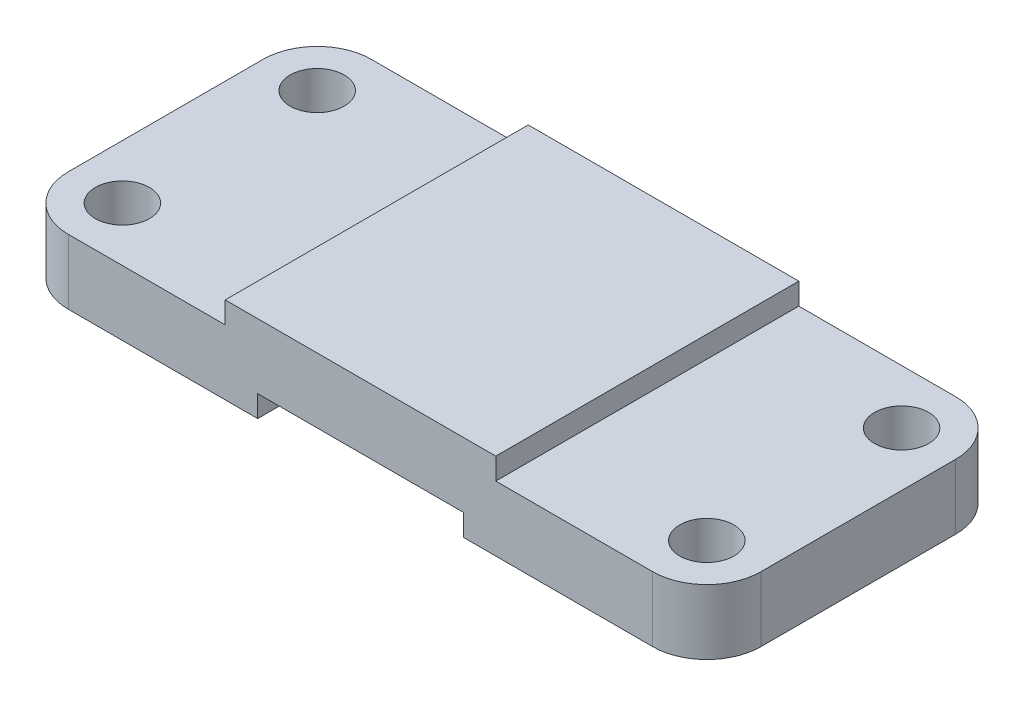
ISO-10303-21;
HEADER;
FILE_DESCRIPTION(('STEP AP214'),'2;1');
FILE_NAME('part.step','',(''),(''),'','','');
FILE_SCHEMA(('AUTOMOTIVE_DESIGN { 1 0 10303 214 1 1 1 1 }'));
ENDSEC;
DATA;
#1=APPLICATION_CONTEXT('core data for automotive mechanical design processes');
#2=APPLICATION_PROTOCOL_DEFINITION('international standard','automotive_design',2000,#1);
#3=PRODUCT_CONTEXT('',#1,'mechanical');
#4=PRODUCT('Part','Part','',(#3));
#5=PRODUCT_RELATED_PRODUCT_CATEGORY('part','',(#4));
#6=PRODUCT_DEFINITION_FORMATION('','',#4);
#7=PRODUCT_DEFINITION_CONTEXT('part definition',#1,'design');
#8=PRODUCT_DEFINITION('design','',#6,#7);
#9=PRODUCT_DEFINITION_SHAPE('','',#8);
#10=(LENGTH_UNIT() NAMED_UNIT(*) SI_UNIT(.MILLI.,.METRE.));
#11=(NAMED_UNIT(*) PLANE_ANGLE_UNIT() SI_UNIT($,.RADIAN.));
#12=(NAMED_UNIT(*) SI_UNIT($,.STERADIAN.) SOLID_ANGLE_UNIT());
#13=UNCERTAINTY_MEASURE_WITH_UNIT(LENGTH_MEASURE(1.E-05),#10,'distance_accuracy_value','');
#14=(GEOMETRIC_REPRESENTATION_CONTEXT(3) GLOBAL_UNCERTAINTY_ASSIGNED_CONTEXT((#13)) GLOBAL_UNIT_ASSIGNED_CONTEXT((#10,
#11,#12)) REPRESENTATION_CONTEXT('',''));
#15=CARTESIAN_POINT('',(0.,0.,0.));
#16=DIRECTION('',(0.,0.,1.));
#17=DIRECTION('',(1.,0.,0.));
#18=AXIS2_PLACEMENT_3D('',#15,#16,#17);
#19=CARTESIAN_POINT('',(0.,0.,0.));
#20=DIRECTION('',(0.,1.,0.));
#21=DIRECTION('',(0.,0.,1.));
#22=AXIS2_PLACEMENT_3D('',#19,#20,#21);
#23=PLANE('',#22);
#24=CARTESIAN_POINT('',(-79.,0.,-10.));
#25=DIRECTION('',(0.,1.,0.));
#26=DIRECTION('',(0.,0.,1.));
#27=AXIS2_PLACEMENT_3D('',#24,#25,#26);
#28=CIRCLE('',#27,5.);
#29=CARTESIAN_POINT('',(-79.,0.,-5.));
#30=VERTEX_POINT('',#29);
#31=EDGE_CURVE('E210',#30,#30,#28,.T.);
#32=ORIENTED_EDGE('',*,*,#31,.T.);
#33=EDGE_LOOP('',(#32));
#34=FACE_BOUND('',#33,.T.);
#35=CARTESIAN_POINT('',(-79.,0.,-46.));
#36=DIRECTION('',(0.,1.,0.));
#37=DIRECTION('',(0.,0.,1.));
#38=AXIS2_PLACEMENT_3D('',#35,#36,#37);
#39=CIRCLE('',#38,5.00000000000001);
#40=CARTESIAN_POINT('',(-79.,0.,-41.));
#41=VERTEX_POINT('',#40);
#42=EDGE_CURVE('E222',#41,#41,#39,.T.);
#43=ORIENTED_EDGE('',*,*,#42,.T.);
#44=EDGE_LOOP('',(#43));
#45=FACE_BOUND('',#44,.T.);
#46=DIRECTION('',(-1.,0.,0.));
#47=VECTOR('',#46,1.);
#48=CARTESIAN_POINT('',(0.,0.,-56.));
#49=LINE('',#48,#47);
#50=CARTESIAN_POINT('',(-44.,0.,-56.));
#51=VERTEX_POINT('',#50);
#52=CARTESIAN_POINT('',(-79.,0.,-56.));
#53=VERTEX_POINT('',#52);
#54=EDGE_CURVE('E293',#51,#53,#49,.T.);
#55=ORIENTED_EDGE('',*,*,#54,.F.);
#56=DIRECTION('',(0.,0.,1.));
#57=VECTOR('',#56,1.);
#58=CARTESIAN_POINT('',(-44.,0.,-56.));
#59=LINE('',#58,#57);
#60=CARTESIAN_POINT('',(-44.,0.,0.));
#61=VERTEX_POINT('',#60);
#62=EDGE_CURVE('E197',#51,#61,#59,.T.);
#63=ORIENTED_EDGE('',*,*,#62,.T.);
#64=DIRECTION('',(-1.,0.,0.));
#65=VECTOR('',#64,1.);
#66=CARTESIAN_POINT('',(0.,0.,0.));
#67=LINE('',#66,#65);
#68=CARTESIAN_POINT('',(-79.,0.,0.));
#69=VERTEX_POINT('',#68);
#70=EDGE_CURVE('E271',#61,#69,#67,.T.);
#71=ORIENTED_EDGE('',*,*,#70,.T.);
#72=CARTESIAN_POINT('',(-79.,0.,-10.));
#73=DIRECTION('',(0.,1.,0.));
#74=DIRECTION('',(0.,0.,1.));
#75=AXIS2_PLACEMENT_3D('',#72,#73,#74);
#76=CIRCLE('',#75,10.);
#77=CARTESIAN_POINT('',(-89.,0.,-10.));
#78=VERTEX_POINT('',#77);
#79=EDGE_CURVE('E317',#69,#78,#76,.F.);
#80=ORIENTED_EDGE('',*,*,#79,.T.);
#81=DIRECTION('',(0.,0.,1.));
#82=VECTOR('',#81,1.);
#83=CARTESIAN_POINT('',(-89.,0.,0.));
#84=LINE('',#83,#82);
#85=CARTESIAN_POINT('',(-89.,0.,-46.));
#86=VERTEX_POINT('',#85);
#87=EDGE_CURVE('E253',#86,#78,#84,.T.);
#88=ORIENTED_EDGE('',*,*,#87,.F.);
#89=CARTESIAN_POINT('',(-79.,0.,-46.));
#90=DIRECTION('',(0.,1.,0.));
#91=DIRECTION('',(0.,0.,1.));
#92=AXIS2_PLACEMENT_3D('',#89,#90,#91);
#93=CIRCLE('',#92,10.);
#94=EDGE_CURVE('E320',#86,#53,#93,.F.);
#95=ORIENTED_EDGE('',*,*,#94,.T.);
#96=EDGE_LOOP('',(#55,#63,#71,#80,#88,#95));
#97=FACE_BOUND('',#96,.T.);
#98=ADVANCED_FACE('F45',(#34,#45,#97),#23,.F.);
#99=CARTESIAN_POINT('',(-50.,16.,0.));
#100=DIRECTION('',(-1.,0.,0.));
#101=DIRECTION('',(0.,0.,1.));
#102=AXIS2_PLACEMENT_3D('',#99,#100,#101);
#103=PLANE('',#102);
#104=DIRECTION('',(0.,0.,-1.));
#105=VECTOR('',#104,1.);
#106=CARTESIAN_POINT('',(-50.,12.,0.));
#107=LINE('',#106,#105);
#108=CARTESIAN_POINT('',(-50.,12.,0.));
#109=VERTEX_POINT('',#108);
#110=CARTESIAN_POINT('',(-50.,12.,-56.));
#111=VERTEX_POINT('',#110);
#112=EDGE_CURVE('E263',#109,#111,#107,.T.);
#113=ORIENTED_EDGE('',*,*,#112,.F.);
#114=DIRECTION('',(0.,-1.,0.));
#115=VECTOR('',#114,1.);
#116=CARTESIAN_POINT('',(-50.,16.,0.));
#117=LINE('',#116,#115);
#118=CARTESIAN_POINT('',(-50.,16.,0.));
#119=VERTEX_POINT('',#118);
#120=EDGE_CURVE('E306',#119,#109,#117,.T.);
#121=ORIENTED_EDGE('',*,*,#120,.F.);
#122=DIRECTION('',(0.,0.,-1.));
#123=VECTOR('',#122,1.);
#124=CARTESIAN_POINT('',(-50.,16.,0.));
#125=LINE('',#124,#123);
#126=CARTESIAN_POINT('',(-50.,16.,-56.));
#127=VERTEX_POINT('',#126);
#128=EDGE_CURVE('E274',#119,#127,#125,.T.);
#129=ORIENTED_EDGE('',*,*,#128,.T.);
#130=DIRECTION('',(0.,-1.,0.));
#131=VECTOR('',#130,1.);
#132=CARTESIAN_POINT('',(-50.,16.,-56.));
#133=LINE('',#132,#131);
#134=EDGE_CURVE('E288',#127,#111,#133,.T.);
#135=ORIENTED_EDGE('',*,*,#134,.T.);
#136=EDGE_LOOP('',(#113,#121,#129,#135));
#137=FACE_BOUND('',#136,.T.);
#138=ADVANCED_FACE('F413',(#137),#103,.T.);
#139=CARTESIAN_POINT('',(0.,16.,0.));
#140=DIRECTION('',(0.,0.,1.));
#141=DIRECTION('',(1.,0.,0.));
#142=AXIS2_PLACEMENT_3D('',#139,#140,#141);
#143=PLANE('',#142);
#144=DIRECTION('',(0.,-1.,0.));
#145=VECTOR('',#144,1.);
#146=CARTESIAN_POINT('',(-44.,0.,0.));
#147=LINE('',#146,#145);
#148=CARTESIAN_POINT('',(-44.,4.,0.));
#149=VERTEX_POINT('',#148);
#150=EDGE_CURVE('E185',#149,#61,#147,.T.);
#151=ORIENTED_EDGE('',*,*,#150,.F.);
#152=DIRECTION('',(-1.,0.,0.));
#153=VECTOR('',#152,1.);
#154=CARTESIAN_POINT('',(-44.,4.,0.));
#155=LINE('',#154,#153);
#156=CARTESIAN_POINT('',(-6.00000000000001,4.,0.));
#157=VERTEX_POINT('',#156);
#158=EDGE_CURVE('E188',#157,#149,#155,.T.);
#159=ORIENTED_EDGE('',*,*,#158,.F.);
#160=DIRECTION('',(0.,1.,0.));
#161=VECTOR('',#160,1.);
#162=CARTESIAN_POINT('',(-6.00000000000001,4.,0.));
#163=LINE('',#162,#161);
#164=CARTESIAN_POINT('',(-6.00000000000001,0.,0.));
#165=VERTEX_POINT('',#164);
#166=EDGE_CURVE('E162',#165,#157,#163,.T.);
#167=ORIENTED_EDGE('',*,*,#166,.F.);
#168=CARTESIAN_POINT('',(29.,0.,0.));
#169=VERTEX_POINT('',#168);
#170=EDGE_CURVE('E289',#169,#165,#67,.T.);
#171=ORIENTED_EDGE('',*,*,#170,.F.);
#172=DIRECTION('',(0.,-1.,0.));
#173=VECTOR('',#172,1.);
#174=CARTESIAN_POINT('',(29.,12.,0.));
#175=LINE('',#174,#173);
#176=CARTESIAN_POINT('',(29.,12.,0.));
#177=VERTEX_POINT('',#176);
#178=EDGE_CURVE('E334',#169,#177,#175,.F.);
#179=ORIENTED_EDGE('',*,*,#178,.T.);
#180=DIRECTION('',(1.,0.,0.));
#181=VECTOR('',#180,1.);
#182=CARTESIAN_POINT('',(0.,12.,0.));
#183=LINE('',#182,#181);
#184=CARTESIAN_POINT('',(0.,12.,0.));
#185=VERTEX_POINT('',#184);
#186=EDGE_CURVE('E249',#185,#177,#183,.T.);
#187=ORIENTED_EDGE('',*,*,#186,.F.);
#188=DIRECTION('',(0.,-1.,0.));
#189=VECTOR('',#188,1.);
#190=CARTESIAN_POINT('',(0.,16.,0.));
#191=LINE('',#190,#189);
#192=CARTESIAN_POINT('',(0.,16.,0.));
#193=VERTEX_POINT('',#192);
#194=EDGE_CURVE('E302',#193,#185,#191,.T.);
#195=ORIENTED_EDGE('',*,*,#194,.F.);
#196=DIRECTION('',(-1.,0.,0.));
#197=VECTOR('',#196,1.);
#198=CARTESIAN_POINT('',(0.,16.,0.));
#199=LINE('',#198,#197);
#200=EDGE_CURVE('E278',#193,#119,#199,.T.);
#201=ORIENTED_EDGE('',*,*,#200,.T.);
#202=ORIENTED_EDGE('',*,*,#120,.T.);
#203=DIRECTION('',(1.,0.,0.));
#204=VECTOR('',#203,1.);
#205=CARTESIAN_POINT('',(0.,12.,0.));
#206=LINE('',#205,#204);
#207=CARTESIAN_POINT('',(-79.,12.,0.));
#208=VERTEX_POINT('',#207);
#209=EDGE_CURVE('E260',#208,#109,#206,.T.);
#210=ORIENTED_EDGE('',*,*,#209,.F.);
#211=DIRECTION('',(0.,-1.,0.));
#212=VECTOR('',#211,1.);
#213=CARTESIAN_POINT('',(-79.,0.,0.));
#214=LINE('',#213,#212);
#215=EDGE_CURVE('E330',#208,#69,#214,.T.);
#216=ORIENTED_EDGE('',*,*,#215,.T.);
#217=ORIENTED_EDGE('',*,*,#70,.F.);
#218=EDGE_LOOP('',(#151,#159,#167,#171,#179,#187,#195,#201,#202,#210,#216,#217));
#219=FACE_BOUND('',#218,.T.);
#220=ADVANCED_FACE('F364',(#219),#143,.T.);
#221=CARTESIAN_POINT('',(0.,16.,0.));
#222=DIRECTION('',(-1.,0.,0.));
#223=DIRECTION('',(0.,0.,1.));
#224=AXIS2_PLACEMENT_3D('',#221,#222,#223);
#225=PLANE('',#224);
#226=ORIENTED_EDGE('',*,*,#194,.T.);
#227=DIRECTION('',(0.,0.,-1.));
#228=VECTOR('',#227,1.);
#229=CARTESIAN_POINT('',(0.,12.,0.));
#230=LINE('',#229,#228);
#231=CARTESIAN_POINT('',(0.,12.,-56.));
#232=VERTEX_POINT('',#231);
#233=EDGE_CURVE('E245',#185,#232,#230,.T.);
#234=ORIENTED_EDGE('',*,*,#233,.T.);
#235=DIRECTION('',(0.,-1.,0.));
#236=VECTOR('',#235,1.);
#237=CARTESIAN_POINT('',(0.,16.,-56.));
#238=LINE('',#237,#236);
#239=CARTESIAN_POINT('',(0.,16.,-56.));
#240=VERTEX_POINT('',#239);
#241=EDGE_CURVE('E298',#240,#232,#238,.T.);
#242=ORIENTED_EDGE('',*,*,#241,.F.);
#243=DIRECTION('',(0.,0.,-1.));
#244=VECTOR('',#243,1.);
#245=CARTESIAN_POINT('',(0.,16.,0.));
#246=LINE('',#245,#244);
#247=EDGE_CURVE('E282',#193,#240,#246,.T.);
#248=ORIENTED_EDGE('',*,*,#247,.F.);
#249=EDGE_LOOP('',(#226,#234,#242,#248));
#250=FACE_BOUND('',#249,.T.);
#251=ADVANCED_FACE('F405',(#250),#225,.F.);
#252=CARTESIAN_POINT('',(0.,16.,-56.));
#253=DIRECTION('',(0.,0.,1.));
#254=DIRECTION('',(1.,0.,0.));
#255=AXIS2_PLACEMENT_3D('',#252,#253,#254);
#256=PLANE('',#255);
#257=DIRECTION('',(-1.,0.,0.));
#258=VECTOR('',#257,1.);
#259=CARTESIAN_POINT('',(-44.,4.,-56.));
#260=LINE('',#259,#258);
#261=CARTESIAN_POINT('',(-6.00000000000001,4.,-56.));
#262=VERTEX_POINT('',#261);
#263=CARTESIAN_POINT('',(-44.,4.,-56.));
#264=VERTEX_POINT('',#263);
#265=EDGE_CURVE('E171',#262,#264,#260,.T.);
#266=ORIENTED_EDGE('',*,*,#265,.T.);
#267=DIRECTION('',(0.,-1.,0.));
#268=VECTOR('',#267,1.);
#269=CARTESIAN_POINT('',(-44.,0.,-56.));
#270=LINE('',#269,#268);
#271=EDGE_CURVE('E177',#264,#51,#270,.T.);
#272=ORIENTED_EDGE('',*,*,#271,.T.);
#273=ORIENTED_EDGE('',*,*,#54,.T.);
#274=DIRECTION('',(0.,-1.,0.));
#275=VECTOR('',#274,1.);
#276=CARTESIAN_POINT('',(-79.,16.,-56.));
#277=LINE('',#276,#275);
#278=CARTESIAN_POINT('',(-79.,12.,-56.));
#279=VERTEX_POINT('',#278);
#280=EDGE_CURVE('E343',#53,#279,#277,.F.);
#281=ORIENTED_EDGE('',*,*,#280,.T.);
#282=DIRECTION('',(-1.,0.,0.));
#283=VECTOR('',#282,1.);
#284=CARTESIAN_POINT('',(0.,12.,-56.));
#285=LINE('',#284,#283);
#286=EDGE_CURVE('E267',#111,#279,#285,.T.);
#287=ORIENTED_EDGE('',*,*,#286,.F.);
#288=ORIENTED_EDGE('',*,*,#134,.F.);
#289=DIRECTION('',(-1.,0.,0.));
#290=VECTOR('',#289,1.);
#291=CARTESIAN_POINT('',(0.,16.,-56.));
#292=LINE('',#291,#290);
#293=EDGE_CURVE('E285',#240,#127,#292,.T.);
#294=ORIENTED_EDGE('',*,*,#293,.F.);
#295=ORIENTED_EDGE('',*,*,#241,.T.);
#296=DIRECTION('',(-1.,0.,0.));
#297=VECTOR('',#296,1.);
#298=CARTESIAN_POINT('',(0.,12.,-56.));
#299=LINE('',#298,#297);
#300=CARTESIAN_POINT('',(29.,12.,-56.));
#301=VERTEX_POINT('',#300);
#302=EDGE_CURVE('E242',#301,#232,#299,.T.);
#303=ORIENTED_EDGE('',*,*,#302,.F.);
#304=DIRECTION('',(0.,-1.,0.));
#305=VECTOR('',#304,1.);
#306=CARTESIAN_POINT('',(29.,16.,-56.));
#307=LINE('',#306,#305);
#308=CARTESIAN_POINT('',(29.,0.,-56.));
#309=VERTEX_POINT('',#308);
#310=EDGE_CURVE('E346',#301,#309,#307,.T.);
#311=ORIENTED_EDGE('',*,*,#310,.T.);
#312=CARTESIAN_POINT('',(-6.00000000000001,0.,-56.));
#313=VERTEX_POINT('',#312);
#314=EDGE_CURVE('E183',#309,#313,#49,.T.);
#315=ORIENTED_EDGE('',*,*,#314,.T.);
#316=DIRECTION('',(0.,1.,0.));
#317=VECTOR('',#316,1.);
#318=CARTESIAN_POINT('',(-6.00000000000001,4.,-56.));
#319=LINE('',#318,#317);
#320=EDGE_CURVE('E61',#313,#262,#319,.T.);
#321=ORIENTED_EDGE('',*,*,#320,.T.);
#322=EDGE_LOOP('',(#266,#272,#273,#281,#287,#288,#294,#295,#303,#311,#315,#321));
#323=FACE_BOUND('',#322,.T.);
#324=ADVANCED_FACE('F180',(#323),#256,.F.);
#325=CARTESIAN_POINT('',(0.,16.,0.));
#326=DIRECTION('',(0.,1.,0.));
#327=DIRECTION('',(0.,0.,1.));
#328=AXIS2_PLACEMENT_3D('',#325,#326,#327);
#329=PLANE('',#328);
#330=ORIENTED_EDGE('',*,*,#128,.F.);
#331=ORIENTED_EDGE('',*,*,#200,.F.);
#332=ORIENTED_EDGE('',*,*,#247,.T.);
#333=ORIENTED_EDGE('',*,*,#293,.T.);
#334=EDGE_LOOP('',(#330,#331,#332,#333));
#335=FACE_BOUND('',#334,.T.);
#336=ADVANCED_FACE('F410',(#335),#329,.T.);
#337=CARTESIAN_POINT('',(29.,0.,-46.));
#338=DIRECTION('',(0.,1.,0.));
#339=DIRECTION('',(0.,0.,1.));
#340=AXIS2_PLACEMENT_3D('',#337,#338,#339);
#341=CIRCLE('',#340,5.);
#342=CARTESIAN_POINT('',(29.,0.,-41.));
#343=VERTEX_POINT('',#342);
#344=EDGE_CURVE('E206',#343,#343,#341,.T.);
#345=ORIENTED_EDGE('',*,*,#344,.T.);
#346=EDGE_LOOP('',(#345));
#347=FACE_BOUND('',#346,.T.);
#348=CARTESIAN_POINT('',(29.,0.,-10.));
#349=DIRECTION('',(0.,1.,0.));
#350=DIRECTION('',(0.,0.,1.));
#351=AXIS2_PLACEMENT_3D('',#348,#349,#350);
#352=CIRCLE('',#351,5.);
#353=CARTESIAN_POINT('',(29.,0.,-5.));
#354=VERTEX_POINT('',#353);
#355=EDGE_CURVE('E201',#354,#354,#352,.T.);
#356=ORIENTED_EDGE('',*,*,#355,.T.);
#357=EDGE_LOOP('',(#356));
#358=FACE_BOUND('',#357,.T.);
#359=ORIENTED_EDGE('',*,*,#170,.T.);
#360=DIRECTION('',(0.,0.,1.));
#361=VECTOR('',#360,1.);
#362=CARTESIAN_POINT('',(-6.00000000000001,0.,-56.));
#363=LINE('',#362,#361);
#364=EDGE_CURVE('E168',#313,#165,#363,.T.);
#365=ORIENTED_EDGE('',*,*,#364,.F.);
#366=ORIENTED_EDGE('',*,*,#314,.F.);
#367=CARTESIAN_POINT('',(29.,0.,-46.));
#368=DIRECTION('',(0.,1.,0.));
#369=DIRECTION('',(0.,0.,1.));
#370=AXIS2_PLACEMENT_3D('',#367,#368,#369);
#371=CIRCLE('',#370,10.);
#372=CARTESIAN_POINT('',(39.,0.,-46.));
#373=VERTEX_POINT('',#372);
#374=EDGE_CURVE('E324',#309,#373,#371,.F.);
#375=ORIENTED_EDGE('',*,*,#374,.T.);
#376=DIRECTION('',(0.,0.,-1.));
#377=VECTOR('',#376,1.);
#378=CARTESIAN_POINT('',(39.,0.,0.));
#379=LINE('',#378,#377);
#380=CARTESIAN_POINT('',(39.,0.,-10.));
#381=VERTEX_POINT('',#380);
#382=EDGE_CURVE('E226',#381,#373,#379,.T.);
#383=ORIENTED_EDGE('',*,*,#382,.F.);
#384=CARTESIAN_POINT('',(29.,0.,-10.));
#385=DIRECTION('',(0.,1.,0.));
#386=DIRECTION('',(0.,0.,1.));
#387=AXIS2_PLACEMENT_3D('',#384,#385,#386);
#388=CIRCLE('',#387,10.);
#389=EDGE_CURVE('E327',#381,#169,#388,.F.);
#390=ORIENTED_EDGE('',*,*,#389,.T.);
#391=EDGE_LOOP('',(#359,#365,#366,#375,#383,#390));
#392=FACE_BOUND('',#391,.T.);
#393=ADVANCED_FACE('F384',(#347,#358,#392),#23,.F.);
#394=CARTESIAN_POINT('',(-89.,12.,0.));
#395=DIRECTION('',(1.,0.,0.));
#396=DIRECTION('',(0.,0.,-1.));
#397=AXIS2_PLACEMENT_3D('',#394,#395,#396);
#398=PLANE('',#397);
#399=DIRECTION('',(0.,0.,1.));
#400=VECTOR('',#399,1.);
#401=CARTESIAN_POINT('',(-89.,12.,0.));
#402=LINE('',#401,#400);
#403=CARTESIAN_POINT('',(-89.,12.,-46.));
#404=VERTEX_POINT('',#403);
#405=CARTESIAN_POINT('',(-89.,12.,-10.));
#406=VERTEX_POINT('',#405);
#407=EDGE_CURVE('E257',#404,#406,#402,.T.);
#408=ORIENTED_EDGE('',*,*,#407,.F.);
#409=DIRECTION('',(0.,-1.,0.));
#410=VECTOR('',#409,1.);
#411=CARTESIAN_POINT('',(-89.,12.,-46.));
#412=LINE('',#411,#410);
#413=EDGE_CURVE('E351',#404,#86,#412,.T.);
#414=ORIENTED_EDGE('',*,*,#413,.T.);
#415=ORIENTED_EDGE('',*,*,#87,.T.);
#416=DIRECTION('',(0.,-1.,0.));
#417=VECTOR('',#416,1.);
#418=CARTESIAN_POINT('',(-89.,12.,-10.));
#419=LINE('',#418,#417);
#420=EDGE_CURVE('E69',#78,#406,#419,.F.);
#421=ORIENTED_EDGE('',*,*,#420,.T.);
#422=EDGE_LOOP('',(#408,#414,#415,#421));
#423=FACE_BOUND('',#422,.T.);
#424=ADVANCED_FACE('F370',(#423),#398,.F.);
#425=CARTESIAN_POINT('',(0.,12.,0.));
#426=DIRECTION('',(0.,1.,0.));
#427=DIRECTION('',(0.,0.,1.));
#428=AXIS2_PLACEMENT_3D('',#425,#426,#427);
#429=PLANE('',#428);
#430=CARTESIAN_POINT('',(-79.,12.,-46.));
#431=DIRECTION('',(0.,1.,0.));
#432=DIRECTION('',(0.,0.,1.));
#433=AXIS2_PLACEMENT_3D('',#430,#431,#432);
#434=CIRCLE('',#433,5.00000000000001);
#435=CARTESIAN_POINT('',(-79.,12.,-41.));
#436=VERTEX_POINT('',#435);
#437=EDGE_CURVE('E227',#436,#436,#434,.T.);
#438=ORIENTED_EDGE('',*,*,#437,.F.);
#439=EDGE_LOOP('',(#438));
#440=FACE_BOUND('',#439,.T.);
#441=CARTESIAN_POINT('',(-79.,12.,-10.));
#442=DIRECTION('',(0.,1.,0.));
#443=DIRECTION('',(0.,0.,1.));
#444=AXIS2_PLACEMENT_3D('',#441,#442,#443);
#445=CIRCLE('',#444,5.);
#446=CARTESIAN_POINT('',(-79.,12.,-5.));
#447=VERTEX_POINT('',#446);
#448=EDGE_CURVE('E231',#447,#447,#445,.T.);
#449=ORIENTED_EDGE('',*,*,#448,.F.);
#450=EDGE_LOOP('',(#449));
#451=FACE_BOUND('',#450,.T.);
#452=ORIENTED_EDGE('',*,*,#286,.T.);
#453=CARTESIAN_POINT('',(-79.,12.,-46.));
#454=DIRECTION('',(0.,1.,0.));
#455=DIRECTION('',(0.,0.,1.));
#456=AXIS2_PLACEMENT_3D('',#453,#454,#455);
#457=CIRCLE('',#456,10.);
#458=EDGE_CURVE('E11',#279,#404,#457,.T.);
#459=ORIENTED_EDGE('',*,*,#458,.T.);
#460=ORIENTED_EDGE('',*,*,#407,.T.);
#461=CARTESIAN_POINT('',(-79.,12.,-10.));
#462=DIRECTION('',(0.,1.,0.));
#463=DIRECTION('',(0.,0.,1.));
#464=AXIS2_PLACEMENT_3D('',#461,#462,#463);
#465=CIRCLE('',#464,10.);
#466=EDGE_CURVE('E54',#406,#208,#465,.T.);
#467=ORIENTED_EDGE('',*,*,#466,.T.);
#468=ORIENTED_EDGE('',*,*,#209,.T.);
#469=ORIENTED_EDGE('',*,*,#112,.T.);
#470=EDGE_LOOP('',(#452,#459,#460,#467,#468,#469));
#471=FACE_BOUND('',#470,.T.);
#472=ADVANCED_FACE('F358',(#440,#451,#471),#429,.T.);
#473=CARTESIAN_POINT('',(39.,12.,0.));
#474=DIRECTION('',(-1.,0.,0.));
#475=DIRECTION('',(0.,0.,1.));
#476=AXIS2_PLACEMENT_3D('',#473,#474,#475);
#477=PLANE('',#476);
#478=DIRECTION('',(0.,0.,-1.));
#479=VECTOR('',#478,1.);
#480=CARTESIAN_POINT('',(39.,12.,0.));
#481=LINE('',#480,#479);
#482=CARTESIAN_POINT('',(39.,12.,-10.));
#483=VERTEX_POINT('',#482);
#484=CARTESIAN_POINT('',(39.,12.,-46.));
#485=VERTEX_POINT('',#484);
#486=EDGE_CURVE('E238',#483,#485,#481,.T.);
#487=ORIENTED_EDGE('',*,*,#486,.F.);
#488=DIRECTION('',(0.,-1.,0.));
#489=VECTOR('',#488,1.);
#490=CARTESIAN_POINT('',(39.,0.,-10.));
#491=LINE('',#490,#489);
#492=EDGE_CURVE('E313',#483,#381,#491,.T.);
#493=ORIENTED_EDGE('',*,*,#492,.T.);
#494=ORIENTED_EDGE('',*,*,#382,.T.);
#495=DIRECTION('',(0.,-1.,0.));
#496=VECTOR('',#495,1.);
#497=CARTESIAN_POINT('',(39.,12.,-46.));
#498=LINE('',#497,#496);
#499=EDGE_CURVE('E310',#373,#485,#498,.F.);
#500=ORIENTED_EDGE('',*,*,#499,.T.);
#501=EDGE_LOOP('',(#487,#493,#494,#500));
#502=FACE_BOUND('',#501,.T.);
#503=ADVANCED_FACE('F392',(#502),#477,.F.);
#504=CARTESIAN_POINT('',(0.,12.,0.));
#505=DIRECTION('',(0.,1.,0.));
#506=DIRECTION('',(0.,0.,1.));
#507=AXIS2_PLACEMENT_3D('',#504,#505,#506);
#508=PLANE('',#507);
#509=CARTESIAN_POINT('',(29.,12.,-46.));
#510=DIRECTION('',(0.,1.,0.));
#511=DIRECTION('',(0.,0.,1.));
#512=AXIS2_PLACEMENT_3D('',#509,#510,#511);
#513=CIRCLE('',#512,5.);
#514=CARTESIAN_POINT('',(29.,12.,-41.));
#515=VERTEX_POINT('',#514);
#516=EDGE_CURVE('E211',#515,#515,#513,.T.);
#517=ORIENTED_EDGE('',*,*,#516,.F.);
#518=EDGE_LOOP('',(#517));
#519=FACE_BOUND('',#518,.T.);
#520=CARTESIAN_POINT('',(29.,12.,-10.));
#521=DIRECTION('',(0.,1.,0.));
#522=DIRECTION('',(0.,0.,1.));
#523=AXIS2_PLACEMENT_3D('',#520,#521,#522);
#524=CIRCLE('',#523,5.);
#525=CARTESIAN_POINT('',(29.,12.,-5.));
#526=VERTEX_POINT('',#525);
#527=EDGE_CURVE('E215',#526,#526,#524,.T.);
#528=ORIENTED_EDGE('',*,*,#527,.F.);
#529=EDGE_LOOP('',(#528));
#530=FACE_BOUND('',#529,.T.);
#531=ORIENTED_EDGE('',*,*,#186,.T.);
#532=CARTESIAN_POINT('',(29.,12.,-10.));
#533=DIRECTION('',(0.,1.,0.));
#534=DIRECTION('',(0.,0.,1.));
#535=AXIS2_PLACEMENT_3D('',#532,#533,#534);
#536=CIRCLE('',#535,10.);
#537=EDGE_CURVE('E340',#177,#483,#536,.T.);
#538=ORIENTED_EDGE('',*,*,#537,.T.);
#539=ORIENTED_EDGE('',*,*,#486,.T.);
#540=CARTESIAN_POINT('',(29.,12.,-46.));
#541=DIRECTION('',(0.,1.,0.));
#542=DIRECTION('',(0.,0.,1.));
#543=AXIS2_PLACEMENT_3D('',#540,#541,#542);
#544=CIRCLE('',#543,10.);
#545=EDGE_CURVE('E337',#485,#301,#544,.T.);
#546=ORIENTED_EDGE('',*,*,#545,.T.);
#547=ORIENTED_EDGE('',*,*,#302,.T.);
#548=ORIENTED_EDGE('',*,*,#233,.F.);
#549=EDGE_LOOP('',(#531,#538,#539,#546,#547,#548));
#550=FACE_BOUND('',#549,.T.);
#551=ADVANCED_FACE('F396',(#519,#530,#550),#508,.T.);
#552=CARTESIAN_POINT('',(29.,12.,-10.));
#553=DIRECTION('',(0.,1.,0.));
#554=DIRECTION('',(0.,0.,1.));
#555=AXIS2_PLACEMENT_3D('',#552,#553,#554);
#556=CYLINDRICAL_SURFACE('',#555,10.);
#557=ORIENTED_EDGE('',*,*,#537,.F.);
#558=ORIENTED_EDGE('',*,*,#178,.F.);
#559=ORIENTED_EDGE('',*,*,#389,.F.);
#560=ORIENTED_EDGE('',*,*,#492,.F.);
#561=EDGE_LOOP('',(#557,#558,#559,#560));
#562=FACE_BOUND('',#561,.T.);
#563=ADVANCED_FACE('F389',(#562),#556,.T.);
#564=CARTESIAN_POINT('',(29.,16.,-46.));
#565=DIRECTION('',(0.,-1.,0.));
#566=DIRECTION('',(0.,0.,-1.));
#567=AXIS2_PLACEMENT_3D('',#564,#565,#566);
#568=CYLINDRICAL_SURFACE('',#567,10.);
#569=ORIENTED_EDGE('',*,*,#545,.F.);
#570=ORIENTED_EDGE('',*,*,#499,.F.);
#571=ORIENTED_EDGE('',*,*,#374,.F.);
#572=ORIENTED_EDGE('',*,*,#310,.F.);
#573=EDGE_LOOP('',(#569,#570,#571,#572));
#574=FACE_BOUND('',#573,.T.);
#575=ADVANCED_FACE('F400',(#574),#568,.T.);
#576=CARTESIAN_POINT('',(-79.,12.,-46.));
#577=DIRECTION('',(0.,-1.,0.));
#578=DIRECTION('',(0.,0.,-1.));
#579=AXIS2_PLACEMENT_3D('',#576,#577,#578);
#580=CYLINDRICAL_SURFACE('',#579,10.);
#581=ORIENTED_EDGE('',*,*,#458,.F.);
#582=ORIENTED_EDGE('',*,*,#280,.F.);
#583=ORIENTED_EDGE('',*,*,#94,.F.);
#584=ORIENTED_EDGE('',*,*,#413,.F.);
#585=EDGE_LOOP('',(#581,#582,#583,#584));
#586=FACE_BOUND('',#585,.T.);
#587=ADVANCED_FACE('F374',(#586),#580,.T.);
#588=CARTESIAN_POINT('',(-79.,16.,-10.));
#589=DIRECTION('',(0.,1.,0.));
#590=DIRECTION('',(0.,0.,1.));
#591=AXIS2_PLACEMENT_3D('',#588,#589,#590);
#592=CYLINDRICAL_SURFACE('',#591,10.);
#593=ORIENTED_EDGE('',*,*,#466,.F.);
#594=ORIENTED_EDGE('',*,*,#420,.F.);
#595=ORIENTED_EDGE('',*,*,#79,.F.);
#596=ORIENTED_EDGE('',*,*,#215,.F.);
#597=EDGE_LOOP('',(#593,#594,#595,#596));
#598=FACE_BOUND('',#597,.T.);
#599=ADVANCED_FACE('F47',(#598),#592,.T.);
#600=CARTESIAN_POINT('',(-79.,0.,-10.));
#601=DIRECTION('',(0.,1.,0.));
#602=DIRECTION('',(0.,0.,1.));
#603=AXIS2_PLACEMENT_3D('',#600,#601,#602);
#604=CYLINDRICAL_SURFACE('',#603,5.);
#605=ORIENTED_EDGE('',*,*,#31,.F.);
#606=EDGE_LOOP('',(#605));
#607=FACE_BOUND('',#606,.T.);
#608=ORIENTED_EDGE('',*,*,#448,.T.);
#609=EDGE_LOOP('',(#608));
#610=FACE_BOUND('',#609,.T.);
#611=ADVANCED_FACE('F432',(#607,#610),#604,.F.);
#612=CARTESIAN_POINT('',(-79.,0.,-46.));
#613=DIRECTION('',(0.,1.,0.));
#614=DIRECTION('',(0.,0.,1.));
#615=AXIS2_PLACEMENT_3D('',#612,#613,#614);
#616=CYLINDRICAL_SURFACE('',#615,5.00000000000001);
#617=ORIENTED_EDGE('',*,*,#42,.F.);
#618=EDGE_LOOP('',(#617));
#619=FACE_BOUND('',#618,.T.);
#620=ORIENTED_EDGE('',*,*,#437,.T.);
#621=EDGE_LOOP('',(#620));
#622=FACE_BOUND('',#621,.T.);
#623=ADVANCED_FACE('F436',(#619,#622),#616,.F.);
#624=CARTESIAN_POINT('',(29.,0.,-10.));
#625=DIRECTION('',(0.,1.,0.));
#626=DIRECTION('',(0.,0.,1.));
#627=AXIS2_PLACEMENT_3D('',#624,#625,#626);
#628=CYLINDRICAL_SURFACE('',#627,5.);
#629=ORIENTED_EDGE('',*,*,#355,.F.);
#630=EDGE_LOOP('',(#629));
#631=FACE_BOUND('',#630,.T.);
#632=ORIENTED_EDGE('',*,*,#527,.T.);
#633=EDGE_LOOP('',(#632));
#634=FACE_BOUND('',#633,.T.);
#635=ADVANCED_FACE('F442',(#631,#634),#628,.F.);
#636=CARTESIAN_POINT('',(29.,0.,-46.));
#637=DIRECTION('',(0.,1.,0.));
#638=DIRECTION('',(0.,0.,1.));
#639=AXIS2_PLACEMENT_3D('',#636,#637,#638);
#640=CYLINDRICAL_SURFACE('',#639,5.);
#641=ORIENTED_EDGE('',*,*,#344,.F.);
#642=EDGE_LOOP('',(#641));
#643=FACE_BOUND('',#642,.T.);
#644=ORIENTED_EDGE('',*,*,#516,.T.);
#645=EDGE_LOOP('',(#644));
#646=FACE_BOUND('',#645,.T.);
#647=ADVANCED_FACE('F542',(#643,#646),#640,.F.);
#648=CARTESIAN_POINT('',(-44.,0.,-56.));
#649=DIRECTION('',(-1.,0.,0.));
#650=DIRECTION('',(0.,0.,1.));
#651=AXIS2_PLACEMENT_3D('',#648,#649,#650);
#652=PLANE('',#651);
#653=ORIENTED_EDGE('',*,*,#150,.T.);
#654=ORIENTED_EDGE('',*,*,#62,.F.);
#655=ORIENTED_EDGE('',*,*,#271,.F.);
#656=DIRECTION('',(0.,0.,1.));
#657=VECTOR('',#656,1.);
#658=CARTESIAN_POINT('',(-44.,4.,-56.));
#659=LINE('',#658,#657);
#660=EDGE_CURVE('E167',#264,#149,#659,.T.);
#661=ORIENTED_EDGE('',*,*,#660,.T.);
#662=EDGE_LOOP('',(#653,#654,#655,#661));
#663=FACE_BOUND('',#662,.T.);
#664=ADVANCED_FACE('F380',(#663),#652,.F.);
#665=CARTESIAN_POINT('',(-44.,4.,-56.));
#666=DIRECTION('',(0.,1.,0.));
#667=DIRECTION('',(0.,0.,1.));
#668=AXIS2_PLACEMENT_3D('',#665,#666,#667);
#669=PLANE('',#668);
#670=ORIENTED_EDGE('',*,*,#158,.T.);
#671=ORIENTED_EDGE('',*,*,#660,.F.);
#672=ORIENTED_EDGE('',*,*,#265,.F.);
#673=DIRECTION('',(0.,0.,1.));
#674=VECTOR('',#673,1.);
#675=CARTESIAN_POINT('',(-6.00000000000001,4.,-56.));
#676=LINE('',#675,#674);
#677=EDGE_CURVE('E158',#262,#157,#676,.T.);
#678=ORIENTED_EDGE('',*,*,#677,.T.);
#679=EDGE_LOOP('',(#670,#671,#672,#678));
#680=FACE_BOUND('',#679,.T.);
#681=ADVANCED_FACE('F172',(#680),#669,.F.);
#682=CARTESIAN_POINT('',(-6.00000000000001,4.,-56.));
#683=DIRECTION('',(1.,0.,0.));
#684=DIRECTION('',(0.,0.,-1.));
#685=AXIS2_PLACEMENT_3D('',#682,#683,#684);
#686=PLANE('',#685);
#687=ORIENTED_EDGE('',*,*,#166,.T.);
#688=ORIENTED_EDGE('',*,*,#677,.F.);
#689=ORIENTED_EDGE('',*,*,#320,.F.);
#690=ORIENTED_EDGE('',*,*,#364,.T.);
#691=EDGE_LOOP('',(#687,#688,#689,#690));
#692=FACE_BOUND('',#691,.T.);
#693=ADVANCED_FACE('F160',(#692),#686,.F.);
#694=CLOSED_SHELL('',(#98,#138,#220,#251,#324,#336,#393,#424,#472,#503,#551,#563,#575,#587,#599,
#611,#623,#635,#647,#664,#681,#693));
#695=MANIFOLD_SOLID_BREP('B2',#694);
#696=ADVANCED_BREP_SHAPE_REPRESENTATION('',(#18,#695),#14);
#697=SHAPE_DEFINITION_REPRESENTATION(#9,#696);
ENDSEC;
END-ISO-10303-21;
